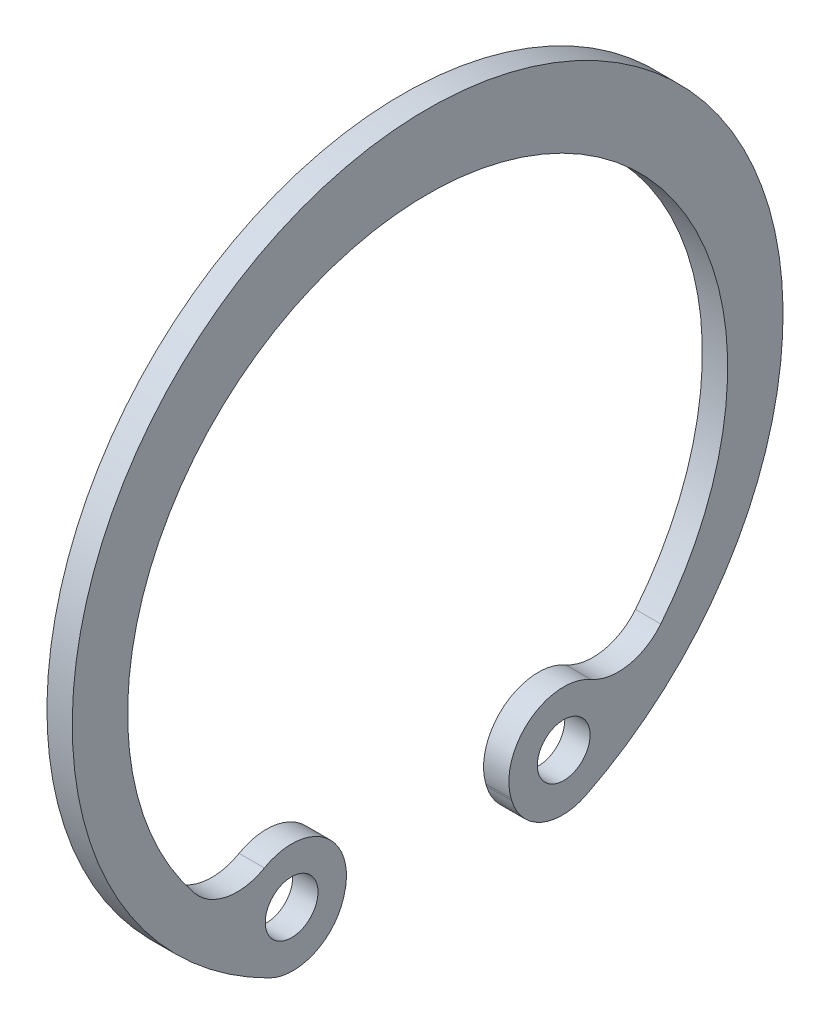
ISO-10303-21;
HEADER;
FILE_DESCRIPTION(('STEP AP214'),'2;1');
FILE_NAME('part.step','',(''),(''),'','','');
FILE_SCHEMA(('AUTOMOTIVE_DESIGN { 1 0 10303 214 1 1 1 1 }'));
ENDSEC;
DATA;
#1=APPLICATION_CONTEXT('core data for automotive mechanical design processes');
#2=APPLICATION_PROTOCOL_DEFINITION('international standard','automotive_design',2000,#1);
#3=PRODUCT_CONTEXT('',#1,'mechanical');
#4=PRODUCT('Part','Part','',(#3));
#5=PRODUCT_RELATED_PRODUCT_CATEGORY('part','',(#4));
#6=PRODUCT_DEFINITION_FORMATION('','',#4);
#7=PRODUCT_DEFINITION_CONTEXT('part definition',#1,'design');
#8=PRODUCT_DEFINITION('design','',#6,#7);
#9=PRODUCT_DEFINITION_SHAPE('','',#8);
#10=(LENGTH_UNIT() NAMED_UNIT(*) SI_UNIT(.MILLI.,.METRE.));
#11=(NAMED_UNIT(*) PLANE_ANGLE_UNIT() SI_UNIT($,.RADIAN.));
#12=(NAMED_UNIT(*) SI_UNIT($,.STERADIAN.) SOLID_ANGLE_UNIT());
#13=UNCERTAINTY_MEASURE_WITH_UNIT(LENGTH_MEASURE(1.E-05),#10,'distance_accuracy_value','');
#14=(GEOMETRIC_REPRESENTATION_CONTEXT(3) GLOBAL_UNCERTAINTY_ASSIGNED_CONTEXT((#13)) GLOBAL_UNIT_ASSIGNED_CONTEXT((#10,
#11,#12)) REPRESENTATION_CONTEXT('',''));
#15=CARTESIAN_POINT('',(0.,0.,0.));
#16=DIRECTION('',(0.,0.,1.));
#17=DIRECTION('',(1.,0.,0.));
#18=AXIS2_PLACEMENT_3D('',#15,#16,#17);
#19=CARTESIAN_POINT('',(0.6,-12.8498054149605,-6.38787920969707));
#20=DIRECTION('',(1.,0.,0.));
#21=DIRECTION('',(0.,0.,-1.));
#22=AXIS2_PLACEMENT_3D('',#19,#20,#21);
#23=PLANE('',#22);
#24=CARTESIAN_POINT('',(0.6,-12.7066911507284,-6.44999999999973));
#25=DIRECTION('',(1.,0.,0.));
#26=DIRECTION('',(0.,0.,-1.));
#27=AXIS2_PLACEMENT_3D('',#24,#25,#26);
#28=CIRCLE('',#27,1.25000000000027);
#29=CARTESIAN_POINT('',(0.6,-12.7066911507284,-7.7));
#30=VERTEX_POINT('',#29);
#31=EDGE_CURVE('E160',#30,#30,#28,.T.);
#32=ORIENTED_EDGE('',*,*,#31,.F.);
#33=EDGE_LOOP('',(#32));
#34=FACE_BOUND('',#33,.T.);
#35=CARTESIAN_POINT('',(0.6,-12.8498054149605,-6.38787920969707));
#36=DIRECTION('',(1.,0.,0.));
#37=DIRECTION('',(0.,0.,-1.));
#38=AXIS2_PLACEMENT_3D('',#35,#36,#37);
#39=CIRCLE('',#38,2.49999999999883);
#40=CARTESIAN_POINT('',(0.6,-13.555650403299,-3.9895917264225));
#41=VERTEX_POINT('',#40);
#42=CARTESIAN_POINT('',(0.6,-15.088447473314,-7.50075015215389));
#43=VERTEX_POINT('',#42);
#44=EDGE_CURVE('E163',#41,#43,#39,.T.);
#45=ORIENTED_EDGE('',*,*,#44,.T.);
#46=CARTESIAN_POINT('',(0.6,1.16985414411186E-13,0.));
#47=DIRECTION('',(1.,0.,0.));
#48=DIRECTION('',(0.,0.,-1.));
#49=AXIS2_PLACEMENT_3D('',#46,#47,#48);
#50=CIRCLE('',#49,16.8499999999999);
#51=CARTESIAN_POINT('',(0.6,-15.088447473314,7.50075015215391));
#52=VERTEX_POINT('',#51);
#53=EDGE_CURVE('E113',#43,#52,#50,.T.);
#54=ORIENTED_EDGE('',*,*,#53,.T.);
#55=CARTESIAN_POINT('',(0.6,-12.8498054149605,6.38787920969707));
#56=DIRECTION('',(1.,0.,0.));
#57=DIRECTION('',(0.,0.,-1.));
#58=AXIS2_PLACEMENT_3D('',#55,#56,#57);
#59=CIRCLE('',#58,2.49999999999883);
#60=CARTESIAN_POINT('',(0.6,-13.555650403299,3.9895917264225));
#61=VERTEX_POINT('',#60);
#62=EDGE_CURVE('E166',#52,#61,#59,.T.);
#63=ORIENTED_EDGE('',*,*,#62,.T.);
#64=DIRECTION('',(0.,0.959314993310026,-0.282337995336412));
#65=VECTOR('',#64,1.);
#66=CARTESIAN_POINT('',(0.6,-13.555650403299,3.9895917264225));
#67=LINE('',#66,#65);
#68=CARTESIAN_POINT('',(0.6,-13.440769938602,3.9557810173936));
#69=VERTEX_POINT('',#68);
#70=EDGE_CURVE('E168',#61,#69,#67,.T.);
#71=ORIENTED_EDGE('',*,*,#70,.T.);
#72=CARTESIAN_POINT('',(0.6,-12.7066911507285,6.44999999999999));
#73=DIRECTION('',(1.,0.,0.));
#74=DIRECTION('',(0.,0.,-1.));
#75=AXIS2_PLACEMENT_3D('',#72,#73,#74);
#76=CIRCLE('',#75,2.59999999999999);
#77=CARTESIAN_POINT('',(0.6,-10.449963954537,7.7411941612204));
#78=VERTEX_POINT('',#77);
#79=EDGE_CURVE('E170',#69,#78,#76,.T.);
#80=ORIENTED_EDGE('',*,*,#79,.T.);
#81=CARTESIAN_POINT('',(0.6,-8.19323669215906,9.03238820675761));
#82=DIRECTION('',(-1.,0.,0.));
#83=DIRECTION('',(0.,0.,1.));
#84=AXIS2_PLACEMENT_3D('',#81,#82,#83);
#85=CIRCLE('',#84,2.59999999999819);
#86=CARTESIAN_POINT('',(0.6,-9.8300036082521,11.052535246548));
#87=VERTEX_POINT('',#86);
#88=EDGE_CURVE('E172',#78,#87,#85,.T.);
#89=ORIENTED_EDGE('',*,*,#88,.T.);
#90=CARTESIAN_POINT('',(0.6,-0.874999999999954,-1.77809156287623E-13));
#91=DIRECTION('',(-1.,0.,0.));
#92=DIRECTION('',(0.,0.,1.));
#93=AXIS2_PLACEMENT_3D('',#90,#91,#92);
#94=CIRCLE('',#93,14.225);
#95=CARTESIAN_POINT('',(0.6,-9.8300034230057,-11.052535396639));
#96=VERTEX_POINT('',#95);
#97=EDGE_CURVE('E174',#87,#96,#94,.T.);
#98=ORIENTED_EDGE('',*,*,#97,.T.);
#99=CARTESIAN_POINT('',(0.6,-8.19323669215797,-9.03238820675741));
#100=DIRECTION('',(-1.,0.,0.));
#101=DIRECTION('',(0.,0.,1.));
#102=AXIS2_PLACEMENT_3D('',#99,#100,#101);
#103=CIRCLE('',#102,2.59999999999932);
#104=CARTESIAN_POINT('',(0.6,-10.449963921443,-7.7411941033787));
#105=VERTEX_POINT('',#104);
#106=EDGE_CURVE('E176',#96,#105,#103,.T.);
#107=ORIENTED_EDGE('',*,*,#106,.T.);
#108=CARTESIAN_POINT('',(0.6,-12.7066911507284,-6.44999999999973));
#109=DIRECTION('',(1.,0.,0.));
#110=DIRECTION('',(0.,0.,-1.));
#111=AXIS2_PLACEMENT_3D('',#108,#109,#110);
#112=CIRCLE('',#111,2.59999999999976);
#113=CARTESIAN_POINT('',(0.6,-13.440769938602,-3.9557810173936));
#114=VERTEX_POINT('',#113);
#115=EDGE_CURVE('E53',#105,#114,#112,.T.);
#116=ORIENTED_EDGE('',*,*,#115,.T.);
#117=DIRECTION('',(0.,-0.959314993310026,-0.282337995336412));
#118=VECTOR('',#117,1.);
#119=CARTESIAN_POINT('',(0.6,-13.440769938602,-3.9557810173936));
#120=LINE('',#119,#118);
#121=EDGE_CURVE('E48',#114,#41,#120,.T.);
#122=ORIENTED_EDGE('',*,*,#121,.T.);
#123=EDGE_LOOP('',(#45,#54,#63,#71,#80,#89,#98,#107,#116,#122));
#124=FACE_BOUND('',#123,.T.);
#125=CARTESIAN_POINT('',(0.6,-12.7066911507285,6.44999999999999));
#126=DIRECTION('',(1.,0.,0.));
#127=DIRECTION('',(0.,0.,-1.));
#128=AXIS2_PLACEMENT_3D('',#125,#126,#127);
#129=CIRCLE('',#128,1.24999999999999);
#130=CARTESIAN_POINT('',(0.6,-12.7066911507285,5.2));
#131=VERTEX_POINT('',#130);
#132=EDGE_CURVE('E157',#131,#131,#129,.T.);
#133=ORIENTED_EDGE('',*,*,#132,.F.);
#134=EDGE_LOOP('',(#133));
#135=FACE_BOUND('',#134,.T.);
#136=ADVANCED_FACE('F33',(#34,#124,#135),#23,.T.);
#137=CARTESIAN_POINT('',(0.6,-12.8498054149605,-6.38787920969707));
#138=DIRECTION('',(-1.,0.,0.));
#139=DIRECTION('',(0.,0.,1.));
#140=AXIS2_PLACEMENT_3D('',#137,#138,#139);
#141=CYLINDRICAL_SURFACE('',#140,2.49999999999883);
#142=DIRECTION('',(-1.,0.,0.));
#143=VECTOR('',#142,1.);
#144=CARTESIAN_POINT('',(0.6,-13.555650403299,-3.9895917264225));
#145=LINE('',#144,#143);
#146=CARTESIAN_POINT('',(-0.6,-13.555650403299,-3.9895917264225));
#147=VERTEX_POINT('',#146);
#148=EDGE_CURVE('E128',#41,#147,#145,.T.);
#149=ORIENTED_EDGE('',*,*,#148,.T.);
#150=CARTESIAN_POINT('',(-0.6,-12.8498054149605,-6.38787920969707));
#151=DIRECTION('',(1.,0.,0.));
#152=DIRECTION('',(0.,0.,-1.));
#153=AXIS2_PLACEMENT_3D('',#150,#151,#152);
#154=CIRCLE('',#153,2.49999999999883);
#155=CARTESIAN_POINT('',(-0.6,-15.088447473314,-7.50075015215389));
#156=VERTEX_POINT('',#155);
#157=EDGE_CURVE('E122',#147,#156,#154,.T.);
#158=ORIENTED_EDGE('',*,*,#157,.T.);
#159=DIRECTION('',(-1.,0.,0.));
#160=VECTOR('',#159,1.);
#161=CARTESIAN_POINT('',(0.6,-15.088447473314,-7.50075015215389));
#162=LINE('',#161,#160);
#163=EDGE_CURVE('E11',#43,#156,#162,.T.);
#164=ORIENTED_EDGE('',*,*,#163,.F.);
#165=ORIENTED_EDGE('',*,*,#44,.F.);
#166=EDGE_LOOP('',(#149,#158,#164,#165));
#167=FACE_BOUND('',#166,.T.);
#168=ADVANCED_FACE('F35',(#167),#141,.T.);
#169=CARTESIAN_POINT('',(0.6,1.16985414411186E-13,0.));
#170=DIRECTION('',(-1.,0.,0.));
#171=DIRECTION('',(0.,0.,1.));
#172=AXIS2_PLACEMENT_3D('',#169,#170,#171);
#173=CYLINDRICAL_SURFACE('',#172,16.8499999999999);
#174=ORIENTED_EDGE('',*,*,#163,.T.);
#175=CARTESIAN_POINT('',(-0.6,1.16985414411186E-13,0.));
#176=DIRECTION('',(1.,0.,0.));
#177=DIRECTION('',(0.,0.,-1.));
#178=AXIS2_PLACEMENT_3D('',#175,#176,#177);
#179=CIRCLE('',#178,16.8499999999999);
#180=CARTESIAN_POINT('',(-0.6,-15.088447473314,7.50075015215391));
#181=VERTEX_POINT('',#180);
#182=EDGE_CURVE('E112',#156,#181,#179,.T.);
#183=ORIENTED_EDGE('',*,*,#182,.T.);
#184=DIRECTION('',(-1.,0.,0.));
#185=VECTOR('',#184,1.);
#186=CARTESIAN_POINT('',(0.6,-15.088447473314,7.50075015215391));
#187=LINE('',#186,#185);
#188=EDGE_CURVE('E41',#52,#181,#187,.T.);
#189=ORIENTED_EDGE('',*,*,#188,.F.);
#190=ORIENTED_EDGE('',*,*,#53,.F.);
#191=EDGE_LOOP('',(#174,#183,#189,#190));
#192=FACE_BOUND('',#191,.T.);
#193=ADVANCED_FACE('F110',(#192),#173,.T.);
#194=CARTESIAN_POINT('',(0.6,-12.8498054149605,6.38787920969707));
#195=DIRECTION('',(-1.,0.,0.));
#196=DIRECTION('',(0.,0.,1.));
#197=AXIS2_PLACEMENT_3D('',#194,#195,#196);
#198=CYLINDRICAL_SURFACE('',#197,2.49999999999883);
#199=ORIENTED_EDGE('',*,*,#188,.T.);
#200=CARTESIAN_POINT('',(-0.6,-12.8498054149605,6.38787920969707));
#201=DIRECTION('',(1.,0.,0.));
#202=DIRECTION('',(0.,0.,-1.));
#203=AXIS2_PLACEMENT_3D('',#200,#201,#202);
#204=CIRCLE('',#203,2.49999999999883);
#205=CARTESIAN_POINT('',(-0.6,-13.555650403299,3.9895917264225));
#206=VERTEX_POINT('',#205);
#207=EDGE_CURVE('E126',#181,#206,#204,.T.);
#208=ORIENTED_EDGE('',*,*,#207,.T.);
#209=DIRECTION('',(-1.,0.,0.));
#210=VECTOR('',#209,1.);
#211=CARTESIAN_POINT('',(0.6,-13.555650403299,3.9895917264225));
#212=LINE('',#211,#210);
#213=EDGE_CURVE('E193',#61,#206,#212,.T.);
#214=ORIENTED_EDGE('',*,*,#213,.F.);
#215=ORIENTED_EDGE('',*,*,#62,.F.);
#216=EDGE_LOOP('',(#199,#208,#214,#215));
#217=FACE_BOUND('',#216,.T.);
#218=ADVANCED_FACE('F196',(#217),#198,.T.);
#219=CARTESIAN_POINT('',(0.6,-13.555650403299,3.9895917264225));
#220=DIRECTION('',(0.,0.282337995336412,0.959314993310026));
#221=DIRECTION('',(0.,-0.959314993310027,0.282337995336412));
#222=AXIS2_PLACEMENT_3D('',#219,#220,#221);
#223=PLANE('',#222);
#224=ORIENTED_EDGE('',*,*,#213,.T.);
#225=DIRECTION('',(0.,0.959314993310026,-0.282337995336412));
#226=VECTOR('',#225,1.);
#227=CARTESIAN_POINT('',(-0.6,-13.555650403299,3.9895917264225));
#228=LINE('',#227,#226);
#229=CARTESIAN_POINT('',(-0.6,-13.440769938602,3.9557810173936));
#230=VERTEX_POINT('',#229);
#231=EDGE_CURVE('E137',#206,#230,#228,.T.);
#232=ORIENTED_EDGE('',*,*,#231,.T.);
#233=DIRECTION('',(-1.,0.,0.));
#234=VECTOR('',#233,1.);
#235=CARTESIAN_POINT('',(0.6,-13.440769938602,3.9557810173936));
#236=LINE('',#235,#234);
#237=EDGE_CURVE('E191',#69,#230,#236,.T.);
#238=ORIENTED_EDGE('',*,*,#237,.F.);
#239=ORIENTED_EDGE('',*,*,#70,.F.);
#240=EDGE_LOOP('',(#224,#232,#238,#239));
#241=FACE_BOUND('',#240,.T.);
#242=ADVANCED_FACE('F204',(#241),#223,.F.);
#243=CARTESIAN_POINT('',(0.6,-12.7066911507285,6.44999999999999));
#244=DIRECTION('',(-1.,0.,0.));
#245=DIRECTION('',(0.,0.,1.));
#246=AXIS2_PLACEMENT_3D('',#243,#244,#245);
#247=CYLINDRICAL_SURFACE('',#246,2.59999999999999);
#248=ORIENTED_EDGE('',*,*,#237,.T.);
#249=CARTESIAN_POINT('',(-0.6,-12.7066911507285,6.44999999999999));
#250=DIRECTION('',(1.,0.,0.));
#251=DIRECTION('',(0.,0.,-1.));
#252=AXIS2_PLACEMENT_3D('',#249,#250,#251);
#253=CIRCLE('',#252,2.59999999999999);
#254=CARTESIAN_POINT('',(-0.6,-10.449963954537,7.7411941612204));
#255=VERTEX_POINT('',#254);
#256=EDGE_CURVE('E140',#230,#255,#253,.T.);
#257=ORIENTED_EDGE('',*,*,#256,.T.);
#258=DIRECTION('',(-1.,0.,0.));
#259=VECTOR('',#258,1.);
#260=CARTESIAN_POINT('',(0.6,-10.449963954537,7.7411941612204));
#261=LINE('',#260,#259);
#262=EDGE_CURVE('E189',#78,#255,#261,.T.);
#263=ORIENTED_EDGE('',*,*,#262,.F.);
#264=ORIENTED_EDGE('',*,*,#79,.F.);
#265=EDGE_LOOP('',(#248,#257,#263,#264));
#266=FACE_BOUND('',#265,.T.);
#267=ADVANCED_FACE('F207',(#266),#247,.T.);
#268=CARTESIAN_POINT('',(0.6,-8.19323669215906,9.03238820675761));
#269=DIRECTION('',(-1.,0.,0.));
#270=DIRECTION('',(0.,0.,1.));
#271=AXIS2_PLACEMENT_3D('',#268,#269,#270);
#272=CYLINDRICAL_SURFACE('',#271,2.59999999999819);
#273=ORIENTED_EDGE('',*,*,#262,.T.);
#274=CARTESIAN_POINT('',(-0.6,-8.19323669215906,9.03238820675761));
#275=DIRECTION('',(-1.,0.,0.));
#276=DIRECTION('',(0.,0.,1.));
#277=AXIS2_PLACEMENT_3D('',#274,#275,#276);
#278=CIRCLE('',#277,2.59999999999819);
#279=CARTESIAN_POINT('',(-0.6,-9.8300036082521,11.052535246548));
#280=VERTEX_POINT('',#279);
#281=EDGE_CURVE('E143',#255,#280,#278,.T.);
#282=ORIENTED_EDGE('',*,*,#281,.T.);
#283=DIRECTION('',(-1.,0.,0.));
#284=VECTOR('',#283,1.);
#285=CARTESIAN_POINT('',(0.6,-9.8300036082521,11.052535246548));
#286=LINE('',#285,#284);
#287=EDGE_CURVE('E187',#87,#280,#286,.T.);
#288=ORIENTED_EDGE('',*,*,#287,.F.);
#289=ORIENTED_EDGE('',*,*,#88,.F.);
#290=EDGE_LOOP('',(#273,#282,#288,#289));
#291=FACE_BOUND('',#290,.T.);
#292=ADVANCED_FACE('F212',(#291),#272,.F.);
#293=CARTESIAN_POINT('',(0.6,-0.874999999999954,-1.77809156287623E-13));
#294=DIRECTION('',(-1.,0.,0.));
#295=DIRECTION('',(0.,0.,1.));
#296=AXIS2_PLACEMENT_3D('',#293,#294,#295);
#297=CYLINDRICAL_SURFACE('',#296,14.225);
#298=ORIENTED_EDGE('',*,*,#287,.T.);
#299=CARTESIAN_POINT('',(-0.6,-0.874999999999954,-1.77809156287623E-13));
#300=DIRECTION('',(-1.,0.,0.));
#301=DIRECTION('',(0.,0.,1.));
#302=AXIS2_PLACEMENT_3D('',#299,#300,#301);
#303=CIRCLE('',#302,14.225);
#304=CARTESIAN_POINT('',(-0.6,-9.8300034230057,-11.052535396639));
#305=VERTEX_POINT('',#304);
#306=EDGE_CURVE('E146',#280,#305,#303,.T.);
#307=ORIENTED_EDGE('',*,*,#306,.T.);
#308=DIRECTION('',(-1.,0.,0.));
#309=VECTOR('',#308,1.);
#310=CARTESIAN_POINT('',(0.6,-9.8300034230057,-11.052535396639));
#311=LINE('',#310,#309);
#312=EDGE_CURVE('E185',#96,#305,#311,.T.);
#313=ORIENTED_EDGE('',*,*,#312,.F.);
#314=ORIENTED_EDGE('',*,*,#97,.F.);
#315=EDGE_LOOP('',(#298,#307,#313,#314));
#316=FACE_BOUND('',#315,.T.);
#317=ADVANCED_FACE('F218',(#316),#297,.F.);
#318=CARTESIAN_POINT('',(0.6,-8.19323669215797,-9.03238820675741));
#319=DIRECTION('',(-1.,0.,0.));
#320=DIRECTION('',(0.,0.,1.));
#321=AXIS2_PLACEMENT_3D('',#318,#319,#320);
#322=CYLINDRICAL_SURFACE('',#321,2.59999999999932);
#323=ORIENTED_EDGE('',*,*,#312,.T.);
#324=CARTESIAN_POINT('',(-0.6,-8.19323669215797,-9.03238820675741));
#325=DIRECTION('',(-1.,0.,0.));
#326=DIRECTION('',(0.,0.,1.));
#327=AXIS2_PLACEMENT_3D('',#324,#325,#326);
#328=CIRCLE('',#327,2.59999999999932);
#329=CARTESIAN_POINT('',(-0.6,-10.449963921443,-7.7411941033787));
#330=VERTEX_POINT('',#329);
#331=EDGE_CURVE('E149',#305,#330,#328,.T.);
#332=ORIENTED_EDGE('',*,*,#331,.T.);
#333=DIRECTION('',(-1.,0.,0.));
#334=VECTOR('',#333,1.);
#335=CARTESIAN_POINT('',(0.6,-10.449963921443,-7.7411941033787));
#336=LINE('',#335,#334);
#337=EDGE_CURVE('E183',#105,#330,#336,.T.);
#338=ORIENTED_EDGE('',*,*,#337,.F.);
#339=ORIENTED_EDGE('',*,*,#106,.F.);
#340=EDGE_LOOP('',(#323,#332,#338,#339));
#341=FACE_BOUND('',#340,.T.);
#342=ADVANCED_FACE('F222',(#341),#322,.F.);
#343=CARTESIAN_POINT('',(0.6,-12.7066911507284,-6.44999999999973));
#344=DIRECTION('',(-1.,0.,0.));
#345=DIRECTION('',(0.,0.,1.));
#346=AXIS2_PLACEMENT_3D('',#343,#344,#345);
#347=CYLINDRICAL_SURFACE('',#346,2.59999999999976);
#348=ORIENTED_EDGE('',*,*,#337,.T.);
#349=CARTESIAN_POINT('',(-0.6,-12.7066911507284,-6.44999999999973));
#350=DIRECTION('',(1.,0.,0.));
#351=DIRECTION('',(0.,0.,-1.));
#352=AXIS2_PLACEMENT_3D('',#349,#350,#351);
#353=CIRCLE('',#352,2.59999999999976);
#354=CARTESIAN_POINT('',(-0.6,-13.440769938602,-3.9557810173936));
#355=VERTEX_POINT('',#354);
#356=EDGE_CURVE('E152',#330,#355,#353,.T.);
#357=ORIENTED_EDGE('',*,*,#356,.T.);
#358=DIRECTION('',(-1.,0.,0.));
#359=VECTOR('',#358,1.);
#360=CARTESIAN_POINT('',(0.6,-13.440769938602,-3.9557810173936));
#361=LINE('',#360,#359);
#362=EDGE_CURVE('E181',#114,#355,#361,.T.);
#363=ORIENTED_EDGE('',*,*,#362,.F.);
#364=ORIENTED_EDGE('',*,*,#115,.F.);
#365=EDGE_LOOP('',(#348,#357,#363,#364));
#366=FACE_BOUND('',#365,.T.);
#367=ADVANCED_FACE('F225',(#366),#347,.T.);
#368=CARTESIAN_POINT('',(0.6,-13.440769938602,-3.9557810173936));
#369=DIRECTION('',(0.,0.282337995336412,-0.959314993310026));
#370=DIRECTION('',(0.,0.959314993310027,0.282337995336412));
#371=AXIS2_PLACEMENT_3D('',#368,#369,#370);
#372=PLANE('',#371);
#373=ORIENTED_EDGE('',*,*,#362,.T.);
#374=DIRECTION('',(0.,-0.959314993310026,-0.282337995336412));
#375=VECTOR('',#374,1.);
#376=CARTESIAN_POINT('',(-0.6,-13.440769938602,-3.9557810173936));
#377=LINE('',#376,#375);
#378=EDGE_CURVE('E155',#355,#147,#377,.T.);
#379=ORIENTED_EDGE('',*,*,#378,.T.);
#380=ORIENTED_EDGE('',*,*,#148,.F.);
#381=ORIENTED_EDGE('',*,*,#121,.F.);
#382=EDGE_LOOP('',(#373,#379,#380,#381));
#383=FACE_BOUND('',#382,.T.);
#384=ADVANCED_FACE('F227',(#383),#372,.F.);
#385=CARTESIAN_POINT('',(0.6,-12.7066911507284,-6.44999999999973));
#386=DIRECTION('',(-1.,0.,0.));
#387=DIRECTION('',(0.,0.,1.));
#388=AXIS2_PLACEMENT_3D('',#385,#386,#387);
#389=CYLINDRICAL_SURFACE('',#388,1.25000000000027);
#390=ORIENTED_EDGE('',*,*,#31,.T.);
#391=EDGE_LOOP('',(#390));
#392=FACE_BOUND('',#391,.T.);
#393=CARTESIAN_POINT('',(-0.6,-12.7066911507284,-6.44999999999973));
#394=DIRECTION('',(1.,0.,0.));
#395=DIRECTION('',(0.,0.,-1.));
#396=AXIS2_PLACEMENT_3D('',#393,#394,#395);
#397=CIRCLE('',#396,1.25000000000027);
#398=CARTESIAN_POINT('',(-0.6,-12.7066911507284,-7.7));
#399=VERTEX_POINT('',#398);
#400=EDGE_CURVE('E129',#399,#399,#397,.T.);
#401=ORIENTED_EDGE('',*,*,#400,.F.);
#402=EDGE_LOOP('',(#401));
#403=FACE_BOUND('',#402,.T.);
#404=ADVANCED_FACE('F229',(#392,#403),#389,.F.);
#405=CARTESIAN_POINT('',(0.6,-12.7066911507285,6.44999999999999));
#406=DIRECTION('',(-1.,0.,0.));
#407=DIRECTION('',(0.,0.,1.));
#408=AXIS2_PLACEMENT_3D('',#405,#406,#407);
#409=CYLINDRICAL_SURFACE('',#408,1.24999999999999);
#410=ORIENTED_EDGE('',*,*,#132,.T.);
#411=EDGE_LOOP('',(#410));
#412=FACE_BOUND('',#411,.T.);
#413=CARTESIAN_POINT('',(-0.6,-12.7066911507285,6.44999999999999));
#414=DIRECTION('',(1.,0.,0.));
#415=DIRECTION('',(0.,0.,-1.));
#416=AXIS2_PLACEMENT_3D('',#413,#414,#415);
#417=CIRCLE('',#416,1.24999999999999);
#418=CARTESIAN_POINT('',(-0.6,-12.7066911507285,5.2));
#419=VERTEX_POINT('',#418);
#420=EDGE_CURVE('E132',#419,#419,#417,.T.);
#421=ORIENTED_EDGE('',*,*,#420,.F.);
#422=EDGE_LOOP('',(#421));
#423=FACE_BOUND('',#422,.T.);
#424=ADVANCED_FACE('F235',(#412,#423),#409,.F.);
#425=CARTESIAN_POINT('',(-0.6,-12.8498054149605,-6.38787920969707));
#426=DIRECTION('',(1.,0.,0.));
#427=DIRECTION('',(0.,0.,-1.));
#428=AXIS2_PLACEMENT_3D('',#425,#426,#427);
#429=PLANE('',#428);
#430=ORIENTED_EDGE('',*,*,#420,.T.);
#431=EDGE_LOOP('',(#430));
#432=FACE_BOUND('',#431,.T.);
#433=ORIENTED_EDGE('',*,*,#400,.T.);
#434=EDGE_LOOP('',(#433));
#435=FACE_BOUND('',#434,.T.);
#436=ORIENTED_EDGE('',*,*,#157,.F.);
#437=ORIENTED_EDGE('',*,*,#378,.F.);
#438=ORIENTED_EDGE('',*,*,#356,.F.);
#439=ORIENTED_EDGE('',*,*,#331,.F.);
#440=ORIENTED_EDGE('',*,*,#306,.F.);
#441=ORIENTED_EDGE('',*,*,#281,.F.);
#442=ORIENTED_EDGE('',*,*,#256,.F.);
#443=ORIENTED_EDGE('',*,*,#231,.F.);
#444=ORIENTED_EDGE('',*,*,#207,.F.);
#445=ORIENTED_EDGE('',*,*,#182,.F.);
#446=EDGE_LOOP('',(#436,#437,#438,#439,#440,#441,#442,#443,#444,#445));
#447=FACE_BOUND('',#446,.T.);
#448=ADVANCED_FACE('F120',(#432,#435,#447),#429,.F.);
#449=CLOSED_SHELL('',(#136,#168,#193,#218,#242,#267,#292,#317,#342,#367,#384,#404,#424,#448));
#450=MANIFOLD_SOLID_BREP('B2',#449);
#451=ADVANCED_BREP_SHAPE_REPRESENTATION('',(#18,#450),#14);
#452=SHAPE_DEFINITION_REPRESENTATION(#9,#451);
ENDSEC;
END-ISO-10303-21;
